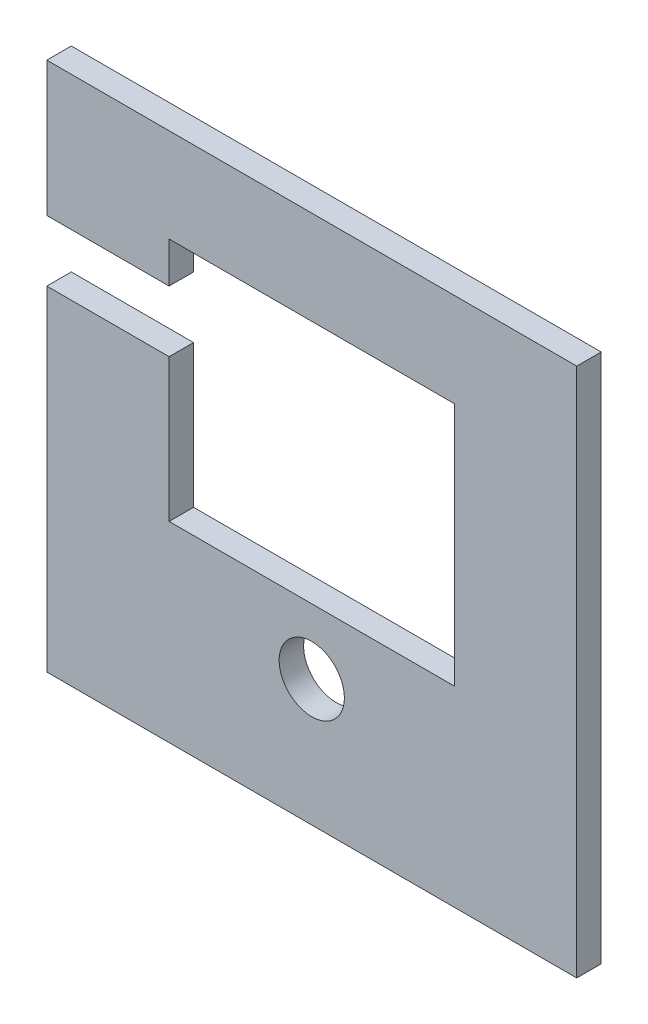
ISO-10303-21;
HEADER;
FILE_DESCRIPTION(('STEP AP214'),'2;1');
FILE_NAME('part.step','',(''),(''),'','','');
FILE_SCHEMA(('AUTOMOTIVE_DESIGN { 1 0 10303 214 1 1 1 1 }'));
ENDSEC;
DATA;
#1=APPLICATION_CONTEXT('core data for automotive mechanical design processes');
#2=APPLICATION_PROTOCOL_DEFINITION('international standard','automotive_design',2000,#1);
#3=PRODUCT_CONTEXT('',#1,'mechanical');
#4=PRODUCT('Part','Part','',(#3));
#5=PRODUCT_RELATED_PRODUCT_CATEGORY('part','',(#4));
#6=PRODUCT_DEFINITION_FORMATION('','',#4);
#7=PRODUCT_DEFINITION_CONTEXT('part definition',#1,'design');
#8=PRODUCT_DEFINITION('design','',#6,#7);
#9=PRODUCT_DEFINITION_SHAPE('','',#8);
#10=(LENGTH_UNIT() NAMED_UNIT(*) SI_UNIT(.MILLI.,.METRE.));
#11=(NAMED_UNIT(*) PLANE_ANGLE_UNIT() SI_UNIT($,.RADIAN.));
#12=(NAMED_UNIT(*) SI_UNIT($,.STERADIAN.) SOLID_ANGLE_UNIT());
#13=UNCERTAINTY_MEASURE_WITH_UNIT(LENGTH_MEASURE(1.E-05),#10,'distance_accuracy_value','');
#14=(GEOMETRIC_REPRESENTATION_CONTEXT(3) GLOBAL_UNCERTAINTY_ASSIGNED_CONTEXT((#13)) GLOBAL_UNIT_ASSIGNED_CONTEXT((#10,
#11,#12)) REPRESENTATION_CONTEXT('',''));
#15=CARTESIAN_POINT('',(0.,0.,0.));
#16=DIRECTION('',(0.,0.,1.));
#17=DIRECTION('',(1.,0.,0.));
#18=AXIS2_PLACEMENT_3D('',#15,#16,#17);
#19=CARTESIAN_POINT('',(-65.,-65.,6.));
#20=DIRECTION('',(1.,0.,0.));
#21=DIRECTION('',(0.,0.,-1.));
#22=AXIS2_PLACEMENT_3D('',#19,#20,#21);
#23=PLANE('',#22);
#24=DIRECTION('',(0.,-1.,0.));
#25=VECTOR('',#24,1.);
#26=CARTESIAN_POINT('',(-65.,-65.,6.));
#27=LINE('',#26,#25);
#28=CARTESIAN_POINT('',(-65.,17.,6.));
#29=VERTEX_POINT('',#28);
#30=CARTESIAN_POINT('',(-65.,-65.,6.));
#31=VERTEX_POINT('',#30);
#32=EDGE_CURVE('E168',#29,#31,#27,.T.);
#33=ORIENTED_EDGE('',*,*,#32,.F.);
#34=DIRECTION('',(0.,0.,1.));
#35=VECTOR('',#34,1.);
#36=CARTESIAN_POINT('',(-65.,17.,-9.));
#37=LINE('',#36,#35);
#38=CARTESIAN_POINT('',(-65.,17.,0.));
#39=VERTEX_POINT('',#38);
#40=EDGE_CURVE('E217',#39,#29,#37,.T.);
#41=ORIENTED_EDGE('',*,*,#40,.F.);
#42=DIRECTION('',(0.,-1.,0.));
#43=VECTOR('',#42,1.);
#44=CARTESIAN_POINT('',(-65.,-65.,0.));
#45=LINE('',#44,#43);
#46=CARTESIAN_POINT('',(-65.,-65.,0.));
#47=VERTEX_POINT('',#46);
#48=EDGE_CURVE('E159',#39,#47,#45,.T.);
#49=ORIENTED_EDGE('',*,*,#48,.T.);
#50=DIRECTION('',(0.,0.,-1.));
#51=VECTOR('',#50,1.);
#52=CARTESIAN_POINT('',(-65.,-65.,6.));
#53=LINE('',#52,#51);
#54=EDGE_CURVE('E192',#31,#47,#53,.T.);
#55=ORIENTED_EDGE('',*,*,#54,.F.);
#56=EDGE_LOOP('',(#33,#41,#49,#55));
#57=FACE_BOUND('',#56,.T.);
#58=ADVANCED_FACE('F35',(#57),#23,.F.);
#59=CARTESIAN_POINT('',(-35.,-18.,-9.));
#60=DIRECTION('',(-1.,0.,0.));
#61=DIRECTION('',(0.,-1.,0.));
#62=AXIS2_PLACEMENT_3D('',#59,#60,#61);
#63=PLANE('',#62);
#64=DIRECTION('',(0.,-1.,0.));
#65=VECTOR('',#64,1.);
#66=CARTESIAN_POINT('',(-35.,0.,0.));
#67=LINE('',#66,#65);
#68=CARTESIAN_POINT('',(-35.,17.,0.));
#69=VERTEX_POINT('',#68);
#70=CARTESIAN_POINT('',(-35.,-18.,0.));
#71=VERTEX_POINT('',#70);
#72=EDGE_CURVE('E204',#69,#71,#67,.T.);
#73=ORIENTED_EDGE('',*,*,#72,.F.);
#74=DIRECTION('',(0.,0.,1.));
#75=VECTOR('',#74,1.);
#76=CARTESIAN_POINT('',(-35.,17.,-9.));
#77=LINE('',#76,#75);
#78=CARTESIAN_POINT('',(-35.,17.,6.));
#79=VERTEX_POINT('',#78);
#80=EDGE_CURVE('E11',#69,#79,#77,.T.);
#81=ORIENTED_EDGE('',*,*,#80,.T.);
#82=DIRECTION('',(0.,-1.,0.));
#83=VECTOR('',#82,1.);
#84=CARTESIAN_POINT('',(-35.,-18.,6.));
#85=LINE('',#84,#83);
#86=CARTESIAN_POINT('',(-35.,-18.,6.));
#87=VERTEX_POINT('',#86);
#88=EDGE_CURVE('E143',#79,#87,#85,.T.);
#89=ORIENTED_EDGE('',*,*,#88,.T.);
#90=DIRECTION('',(0.,0.,1.));
#91=VECTOR('',#90,1.);
#92=CARTESIAN_POINT('',(-35.,-18.,-9.));
#93=LINE('',#92,#91);
#94=EDGE_CURVE('E157',#71,#87,#93,.T.);
#95=ORIENTED_EDGE('',*,*,#94,.F.);
#96=EDGE_LOOP('',(#73,#81,#89,#95));
#97=FACE_BOUND('',#96,.T.);
#98=ADVANCED_FACE('F260',(#97),#63,.F.);
#99=CARTESIAN_POINT('',(-65.,65.,0.));
#100=VERTEX_POINT('',#99);
#101=CARTESIAN_POINT('',(-65.,32.,0.));
#102=VERTEX_POINT('',#101);
#103=EDGE_CURVE('E175',#100,#102,#45,.T.);
#104=ORIENTED_EDGE('',*,*,#103,.T.);
#105=DIRECTION('',(0.,0.,1.));
#106=VECTOR('',#105,1.);
#107=CARTESIAN_POINT('',(-65.,32.,-9.));
#108=LINE('',#107,#106);
#109=CARTESIAN_POINT('',(-65.,32.,6.));
#110=VERTEX_POINT('',#109);
#111=EDGE_CURVE('E220',#102,#110,#108,.T.);
#112=ORIENTED_EDGE('',*,*,#111,.T.);
#113=CARTESIAN_POINT('',(-65.,65.,6.));
#114=VERTEX_POINT('',#113);
#115=EDGE_CURVE('E136',#114,#110,#27,.T.);
#116=ORIENTED_EDGE('',*,*,#115,.F.);
#117=DIRECTION('',(0.,0.,-1.));
#118=VECTOR('',#117,1.);
#119=CARTESIAN_POINT('',(-65.,65.,6.));
#120=LINE('',#119,#118);
#121=EDGE_CURVE('E174',#114,#100,#120,.T.);
#122=ORIENTED_EDGE('',*,*,#121,.T.);
#123=EDGE_LOOP('',(#104,#112,#116,#122));
#124=FACE_BOUND('',#123,.T.);
#125=ADVANCED_FACE('F37',(#124),#23,.F.);
#126=CARTESIAN_POINT('',(65.,-65.,6.));
#127=DIRECTION('',(0.,1.,0.));
#128=DIRECTION('',(-1.,0.,0.));
#129=AXIS2_PLACEMENT_3D('',#126,#127,#128);
#130=PLANE('',#129);
#131=DIRECTION('',(1.,0.,0.));
#132=VECTOR('',#131,1.);
#133=CARTESIAN_POINT('',(65.,-65.,0.));
#134=LINE('',#133,#132);
#135=CARTESIAN_POINT('',(65.,-65.,0.));
#136=VERTEX_POINT('',#135);
#137=EDGE_CURVE('E178',#47,#136,#134,.T.);
#138=ORIENTED_EDGE('',*,*,#137,.T.);
#139=DIRECTION('',(0.,0.,-1.));
#140=VECTOR('',#139,1.);
#141=CARTESIAN_POINT('',(65.,-65.,6.));
#142=LINE('',#141,#140);
#143=CARTESIAN_POINT('',(65.,-65.,6.));
#144=VERTEX_POINT('',#143);
#145=EDGE_CURVE('E189',#144,#136,#142,.T.);
#146=ORIENTED_EDGE('',*,*,#145,.F.);
#147=DIRECTION('',(1.,0.,0.));
#148=VECTOR('',#147,1.);
#149=CARTESIAN_POINT('',(65.,-65.,6.));
#150=LINE('',#149,#148);
#151=EDGE_CURVE('E167',#31,#144,#150,.T.);
#152=ORIENTED_EDGE('',*,*,#151,.F.);
#153=ORIENTED_EDGE('',*,*,#54,.T.);
#154=EDGE_LOOP('',(#138,#146,#152,#153));
#155=FACE_BOUND('',#154,.T.);
#156=ADVANCED_FACE('F233',(#155),#130,.F.);
#157=CARTESIAN_POINT('',(65.,-65.,6.));
#158=DIRECTION('',(-1.,0.,0.));
#159=DIRECTION('',(0.,0.,1.));
#160=AXIS2_PLACEMENT_3D('',#157,#158,#159);
#161=PLANE('',#160);
#162=DIRECTION('',(0.,1.,0.));
#163=VECTOR('',#162,1.);
#164=CARTESIAN_POINT('',(65.,-65.,0.));
#165=LINE('',#164,#163);
#166=CARTESIAN_POINT('',(65.,65.,0.));
#167=VERTEX_POINT('',#166);
#168=EDGE_CURVE('E180',#136,#167,#165,.T.);
#169=ORIENTED_EDGE('',*,*,#168,.T.);
#170=DIRECTION('',(0.,0.,-1.));
#171=VECTOR('',#170,1.);
#172=CARTESIAN_POINT('',(65.,65.,6.));
#173=LINE('',#172,#171);
#174=CARTESIAN_POINT('',(65.,65.,6.));
#175=VERTEX_POINT('',#174);
#176=EDGE_CURVE('E186',#175,#167,#173,.T.);
#177=ORIENTED_EDGE('',*,*,#176,.F.);
#178=DIRECTION('',(0.,1.,0.));
#179=VECTOR('',#178,1.);
#180=CARTESIAN_POINT('',(65.,-65.,6.));
#181=LINE('',#180,#179);
#182=EDGE_CURVE('E170',#144,#175,#181,.T.);
#183=ORIENTED_EDGE('',*,*,#182,.F.);
#184=ORIENTED_EDGE('',*,*,#145,.T.);
#185=EDGE_LOOP('',(#169,#177,#183,#184));
#186=FACE_BOUND('',#185,.T.);
#187=ADVANCED_FACE('F240',(#186),#161,.F.);
#188=CARTESIAN_POINT('',(65.,65.,6.));
#189=DIRECTION('',(0.,-1.,0.));
#190=DIRECTION('',(1.,0.,0.));
#191=AXIS2_PLACEMENT_3D('',#188,#189,#190);
#192=PLANE('',#191);
#193=DIRECTION('',(-1.,0.,0.));
#194=VECTOR('',#193,1.);
#195=CARTESIAN_POINT('',(65.,65.,0.));
#196=LINE('',#195,#194);
#197=EDGE_CURVE('E182',#167,#100,#196,.T.);
#198=ORIENTED_EDGE('',*,*,#197,.T.);
#199=ORIENTED_EDGE('',*,*,#121,.F.);
#200=DIRECTION('',(-1.,0.,0.));
#201=VECTOR('',#200,1.);
#202=CARTESIAN_POINT('',(65.,65.,6.));
#203=LINE('',#202,#201);
#204=EDGE_CURVE('E172',#175,#114,#203,.T.);
#205=ORIENTED_EDGE('',*,*,#204,.F.);
#206=ORIENTED_EDGE('',*,*,#176,.T.);
#207=EDGE_LOOP('',(#198,#199,#205,#206));
#208=FACE_BOUND('',#207,.T.);
#209=ADVANCED_FACE('F244',(#208),#192,.F.);
#210=CARTESIAN_POINT('',(0.,0.,6.));
#211=DIRECTION('',(0.,0.,1.));
#212=DIRECTION('',(1.,0.,0.));
#213=AXIS2_PLACEMENT_3D('',#210,#211,#212);
#214=PLANE('',#213);
#215=DIRECTION('',(1.,0.,0.));
#216=VECTOR('',#215,1.);
#217=CARTESIAN_POINT('',(-65.,17.,6.));
#218=LINE('',#217,#216);
#219=EDGE_CURVE('E58',#29,#79,#218,.T.);
#220=ORIENTED_EDGE('',*,*,#219,.F.);
#221=ORIENTED_EDGE('',*,*,#32,.T.);
#222=ORIENTED_EDGE('',*,*,#151,.T.);
#223=ORIENTED_EDGE('',*,*,#182,.T.);
#224=ORIENTED_EDGE('',*,*,#204,.T.);
#225=ORIENTED_EDGE('',*,*,#115,.T.);
#226=DIRECTION('',(-1.,0.,0.));
#227=VECTOR('',#226,1.);
#228=CARTESIAN_POINT('',(-65.,32.,6.));
#229=LINE('',#228,#227);
#230=CARTESIAN_POINT('',(-35.,32.,6.));
#231=VERTEX_POINT('',#230);
#232=EDGE_CURVE('E122',#231,#110,#229,.T.);
#233=ORIENTED_EDGE('',*,*,#232,.F.);
#234=CARTESIAN_POINT('',(-35.,42.,6.));
#235=VERTEX_POINT('',#234);
#236=EDGE_CURVE('E134',#235,#231,#85,.T.);
#237=ORIENTED_EDGE('',*,*,#236,.F.);
#238=DIRECTION('',(-1.,0.,0.));
#239=VECTOR('',#238,1.);
#240=CARTESIAN_POINT('',(35.,42.,6.));
#241=LINE('',#240,#239);
#242=CARTESIAN_POINT('',(35.,42.,6.));
#243=VERTEX_POINT('',#242);
#244=EDGE_CURVE('E155',#243,#235,#241,.T.);
#245=ORIENTED_EDGE('',*,*,#244,.F.);
#246=DIRECTION('',(0.,1.,0.));
#247=VECTOR('',#246,1.);
#248=CARTESIAN_POINT('',(35.,-18.,6.));
#249=LINE('',#248,#247);
#250=CARTESIAN_POINT('',(35.,-18.,6.));
#251=VERTEX_POINT('',#250);
#252=EDGE_CURVE('E146',#251,#243,#249,.T.);
#253=ORIENTED_EDGE('',*,*,#252,.F.);
#254=DIRECTION('',(1.,0.,0.));
#255=VECTOR('',#254,1.);
#256=CARTESIAN_POINT('',(35.,-18.,6.));
#257=LINE('',#256,#255);
#258=EDGE_CURVE('E142',#87,#251,#257,.T.);
#259=ORIENTED_EDGE('',*,*,#258,.F.);
#260=ORIENTED_EDGE('',*,*,#88,.F.);
#261=EDGE_LOOP('',(#220,#221,#222,#223,#224,#225,#233,#237,#245,#253,#259,#260));
#262=FACE_BOUND('',#261,.T.);
#263=CARTESIAN_POINT('',(0.,-34.,6.));
#264=DIRECTION('',(0.,0.,1.));
#265=DIRECTION('',(1.,0.,0.));
#266=AXIS2_PLACEMENT_3D('',#263,#264,#265);
#267=CIRCLE('',#266,8.);
#268=CARTESIAN_POINT('',(7.99999999999999,-34.,6.));
#269=VERTEX_POINT('',#268);
#270=EDGE_CURVE('E150',#269,#269,#267,.T.);
#271=ORIENTED_EDGE('',*,*,#270,.F.);
#272=EDGE_LOOP('',(#271));
#273=FACE_BOUND('',#272,.T.);
#274=ADVANCED_FACE('F131',(#262,#273),#214,.T.);
#275=CARTESIAN_POINT('',(0.,0.,0.));
#276=DIRECTION('',(0.,0.,1.));
#277=DIRECTION('',(1.,0.,0.));
#278=AXIS2_PLACEMENT_3D('',#275,#276,#277);
#279=PLANE('',#278);
#280=CARTESIAN_POINT('',(0.,-34.,0.));
#281=DIRECTION('',(0.,0.,1.));
#282=DIRECTION('',(1.,0.,0.));
#283=AXIS2_PLACEMENT_3D('',#280,#281,#282);
#284=CIRCLE('',#283,8.);
#285=CARTESIAN_POINT('',(7.99999999999999,-34.,0.));
#286=VERTEX_POINT('',#285);
#287=EDGE_CURVE('E148',#286,#286,#284,.T.);
#288=ORIENTED_EDGE('',*,*,#287,.T.);
#289=EDGE_LOOP('',(#288));
#290=FACE_BOUND('',#289,.T.);
#291=ORIENTED_EDGE('',*,*,#48,.F.);
#292=DIRECTION('',(1.,0.,0.));
#293=VECTOR('',#292,1.);
#294=CARTESIAN_POINT('',(0.,17.,0.));
#295=LINE('',#294,#293);
#296=EDGE_CURVE('E210',#39,#69,#295,.T.);
#297=ORIENTED_EDGE('',*,*,#296,.T.);
#298=ORIENTED_EDGE('',*,*,#72,.T.);
#299=DIRECTION('',(1.,0.,0.));
#300=VECTOR('',#299,1.);
#301=CARTESIAN_POINT('',(0.,-18.,0.));
#302=LINE('',#301,#300);
#303=CARTESIAN_POINT('',(35.,-18.,0.));
#304=VERTEX_POINT('',#303);
#305=EDGE_CURVE('E195',#71,#304,#302,.T.);
#306=ORIENTED_EDGE('',*,*,#305,.T.);
#307=DIRECTION('',(0.,1.,0.));
#308=VECTOR('',#307,1.);
#309=CARTESIAN_POINT('',(35.,0.,0.));
#310=LINE('',#309,#308);
#311=CARTESIAN_POINT('',(35.,42.,0.));
#312=VERTEX_POINT('',#311);
#313=EDGE_CURVE('E198',#304,#312,#310,.T.);
#314=ORIENTED_EDGE('',*,*,#313,.T.);
#315=DIRECTION('',(-1.,0.,0.));
#316=VECTOR('',#315,1.);
#317=CARTESIAN_POINT('',(0.,42.,0.));
#318=LINE('',#317,#316);
#319=CARTESIAN_POINT('',(-35.,42.,0.));
#320=VERTEX_POINT('',#319);
#321=EDGE_CURVE('E201',#312,#320,#318,.T.);
#322=ORIENTED_EDGE('',*,*,#321,.T.);
#323=CARTESIAN_POINT('',(-35.,32.,0.));
#324=VERTEX_POINT('',#323);
#325=EDGE_CURVE('E127',#320,#324,#67,.T.);
#326=ORIENTED_EDGE('',*,*,#325,.T.);
#327=DIRECTION('',(-1.,0.,0.));
#328=VECTOR('',#327,1.);
#329=CARTESIAN_POINT('',(0.,32.,0.));
#330=LINE('',#329,#328);
#331=EDGE_CURVE('E50',#324,#102,#330,.T.);
#332=ORIENTED_EDGE('',*,*,#331,.T.);
#333=ORIENTED_EDGE('',*,*,#103,.F.);
#334=ORIENTED_EDGE('',*,*,#197,.F.);
#335=ORIENTED_EDGE('',*,*,#168,.F.);
#336=ORIENTED_EDGE('',*,*,#137,.F.);
#337=EDGE_LOOP('',(#291,#297,#298,#306,#314,#322,#326,#332,#333,#334,#335,#336));
#338=FACE_BOUND('',#337,.T.);
#339=ADVANCED_FACE('F247',(#290,#338),#279,.F.);
#340=ORIENTED_EDGE('',*,*,#236,.T.);
#341=DIRECTION('',(0.,0.,-1.));
#342=VECTOR('',#341,1.);
#343=CARTESIAN_POINT('',(-35.,32.,-9.));
#344=LINE('',#343,#342);
#345=EDGE_CURVE('E43',#231,#324,#344,.T.);
#346=ORIENTED_EDGE('',*,*,#345,.T.);
#347=ORIENTED_EDGE('',*,*,#325,.F.);
#348=DIRECTION('',(0.,0.,1.));
#349=VECTOR('',#348,1.);
#350=CARTESIAN_POINT('',(-35.,42.,-9.));
#351=LINE('',#350,#349);
#352=EDGE_CURVE('E140',#320,#235,#351,.T.);
#353=ORIENTED_EDGE('',*,*,#352,.T.);
#354=EDGE_LOOP('',(#340,#346,#347,#353));
#355=FACE_BOUND('',#354,.T.);
#356=ADVANCED_FACE('F138',(#355),#63,.F.);
#357=CARTESIAN_POINT('',(35.,42.,-9.));
#358=DIRECTION('',(0.,1.,0.));
#359=DIRECTION('',(-1.,0.,0.));
#360=AXIS2_PLACEMENT_3D('',#357,#358,#359);
#361=PLANE('',#360);
#362=DIRECTION('',(0.,0.,1.));
#363=VECTOR('',#362,1.);
#364=CARTESIAN_POINT('',(35.,42.,-9.));
#365=LINE('',#364,#363);
#366=EDGE_CURVE('E160',#312,#243,#365,.T.);
#367=ORIENTED_EDGE('',*,*,#366,.T.);
#368=ORIENTED_EDGE('',*,*,#244,.T.);
#369=ORIENTED_EDGE('',*,*,#352,.F.);
#370=ORIENTED_EDGE('',*,*,#321,.F.);
#371=EDGE_LOOP('',(#367,#368,#369,#370));
#372=FACE_BOUND('',#371,.T.);
#373=ADVANCED_FACE('F249',(#372),#361,.F.);
#374=CARTESIAN_POINT('',(35.,-18.,-9.));
#375=DIRECTION('',(1.,0.,0.));
#376=DIRECTION('',(0.,1.,0.));
#377=AXIS2_PLACEMENT_3D('',#374,#375,#376);
#378=PLANE('',#377);
#379=DIRECTION('',(0.,0.,1.));
#380=VECTOR('',#379,1.);
#381=CARTESIAN_POINT('',(35.,-18.,-9.));
#382=LINE('',#381,#380);
#383=EDGE_CURVE('E162',#304,#251,#382,.T.);
#384=ORIENTED_EDGE('',*,*,#383,.T.);
#385=ORIENTED_EDGE('',*,*,#252,.T.);
#386=ORIENTED_EDGE('',*,*,#366,.F.);
#387=ORIENTED_EDGE('',*,*,#313,.F.);
#388=EDGE_LOOP('',(#384,#385,#386,#387));
#389=FACE_BOUND('',#388,.T.);
#390=ADVANCED_FACE('F253',(#389),#378,.F.);
#391=CARTESIAN_POINT('',(35.,-18.,-9.));
#392=DIRECTION('',(0.,-1.,0.));
#393=DIRECTION('',(1.,0.,0.));
#394=AXIS2_PLACEMENT_3D('',#391,#392,#393);
#395=PLANE('',#394);
#396=ORIENTED_EDGE('',*,*,#94,.T.);
#397=ORIENTED_EDGE('',*,*,#258,.T.);
#398=ORIENTED_EDGE('',*,*,#383,.F.);
#399=ORIENTED_EDGE('',*,*,#305,.F.);
#400=EDGE_LOOP('',(#396,#397,#398,#399));
#401=FACE_BOUND('',#400,.T.);
#402=ADVANCED_FACE('F257',(#401),#395,.F.);
#403=CARTESIAN_POINT('',(0.,-34.,-9.));
#404=DIRECTION('',(0.,0.,1.));
#405=DIRECTION('',(1.,0.,0.));
#406=AXIS2_PLACEMENT_3D('',#403,#404,#405);
#407=CYLINDRICAL_SURFACE('',#406,8.);
#408=ORIENTED_EDGE('',*,*,#270,.T.);
#409=EDGE_LOOP('',(#408));
#410=FACE_BOUND('',#409,.T.);
#411=ORIENTED_EDGE('',*,*,#287,.F.);
#412=EDGE_LOOP('',(#411));
#413=FACE_BOUND('',#412,.T.);
#414=ADVANCED_FACE('F321',(#410,#413),#407,.F.);
#415=CARTESIAN_POINT('',(-65.,32.,-9.));
#416=DIRECTION('',(0.,1.,0.));
#417=DIRECTION('',(0.,0.,1.));
#418=AXIS2_PLACEMENT_3D('',#415,#416,#417);
#419=PLANE('',#418);
#420=ORIENTED_EDGE('',*,*,#345,.F.);
#421=ORIENTED_EDGE('',*,*,#232,.T.);
#422=ORIENTED_EDGE('',*,*,#111,.F.);
#423=ORIENTED_EDGE('',*,*,#331,.F.);
#424=EDGE_LOOP('',(#420,#421,#422,#423));
#425=FACE_BOUND('',#424,.T.);
#426=ADVANCED_FACE('F121',(#425),#419,.F.);
#427=CARTESIAN_POINT('',(-65.,17.,-9.));
#428=DIRECTION('',(0.,-1.,0.));
#429=DIRECTION('',(0.,0.,-1.));
#430=AXIS2_PLACEMENT_3D('',#427,#428,#429);
#431=PLANE('',#430);
#432=ORIENTED_EDGE('',*,*,#40,.T.);
#433=ORIENTED_EDGE('',*,*,#219,.T.);
#434=ORIENTED_EDGE('',*,*,#80,.F.);
#435=ORIENTED_EDGE('',*,*,#296,.F.);
#436=EDGE_LOOP('',(#432,#433,#434,#435));
#437=FACE_BOUND('',#436,.T.);
#438=ADVANCED_FACE('F224',(#437),#431,.F.);
#439=CLOSED_SHELL('',(#58,#98,#125,#156,#187,#209,#274,#339,#356,#373,#390,#402,#414,#426,#438));
#440=MANIFOLD_SOLID_BREP('B2',#439);
#441=ADVANCED_BREP_SHAPE_REPRESENTATION('',(#18,#440),#14);
#442=SHAPE_DEFINITION_REPRESENTATION(#9,#441);
ENDSEC;
END-ISO-10303-21;
